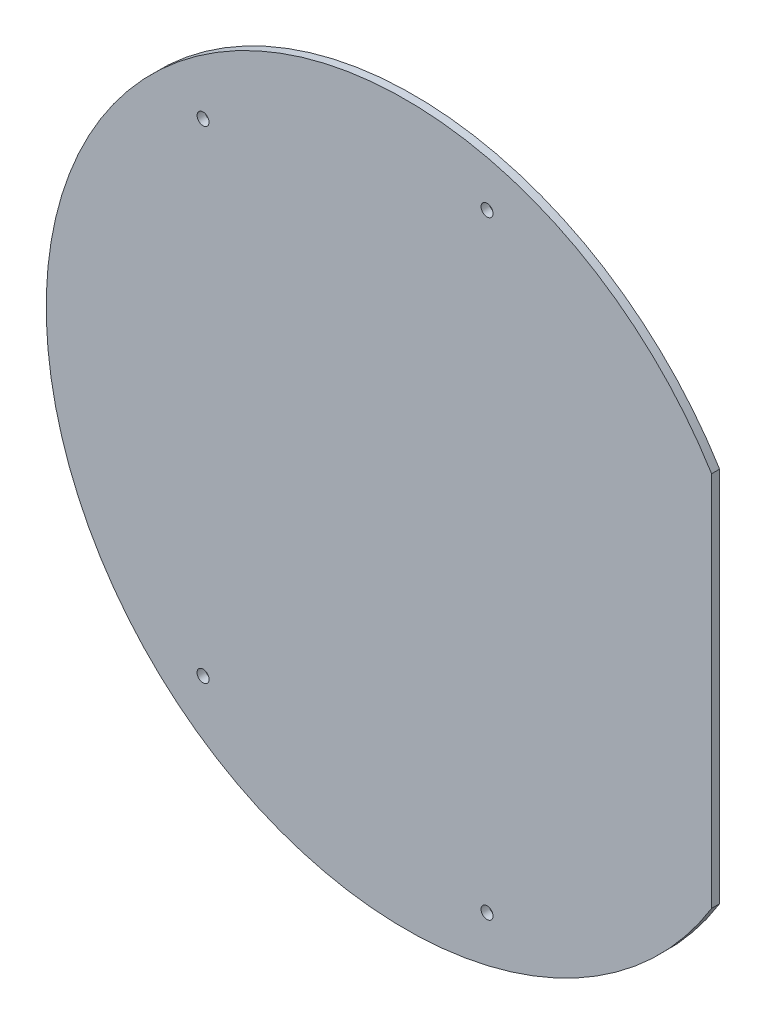
ISO-10303-21;
HEADER;
FILE_DESCRIPTION(('STEP AP214'),'2;1');
FILE_NAME('part.step','',(''),(''),'','','');
FILE_SCHEMA(('AUTOMOTIVE_DESIGN { 1 0 10303 214 1 1 1 1 }'));
ENDSEC;
DATA;
#1=APPLICATION_CONTEXT('core data for automotive mechanical design processes');
#2=APPLICATION_PROTOCOL_DEFINITION('international standard','automotive_design',2000,#1);
#3=PRODUCT_CONTEXT('',#1,'mechanical');
#4=PRODUCT('Part','Part','',(#3));
#5=PRODUCT_RELATED_PRODUCT_CATEGORY('part','',(#4));
#6=PRODUCT_DEFINITION_FORMATION('','',#4);
#7=PRODUCT_DEFINITION_CONTEXT('part definition',#1,'design');
#8=PRODUCT_DEFINITION('design','',#6,#7);
#9=PRODUCT_DEFINITION_SHAPE('','',#8);
#10=(LENGTH_UNIT() NAMED_UNIT(*) SI_UNIT(.MILLI.,.METRE.));
#11=(NAMED_UNIT(*) PLANE_ANGLE_UNIT() SI_UNIT($,.RADIAN.));
#12=(NAMED_UNIT(*) SI_UNIT($,.STERADIAN.) SOLID_ANGLE_UNIT());
#13=UNCERTAINTY_MEASURE_WITH_UNIT(LENGTH_MEASURE(1.E-05),#10,'distance_accuracy_value','');
#14=(GEOMETRIC_REPRESENTATION_CONTEXT(3) GLOBAL_UNCERTAINTY_ASSIGNED_CONTEXT((#13)) GLOBAL_UNIT_ASSIGNED_CONTEXT((#10,
#11,#12)) REPRESENTATION_CONTEXT('',''));
#15=CARTESIAN_POINT('',(0.,0.,0.));
#16=DIRECTION('',(0.,0.,1.));
#17=DIRECTION('',(1.,0.,0.));
#18=AXIS2_PLACEMENT_3D('',#15,#16,#17);
#19=CARTESIAN_POINT('',(115.,-70.7106781186548,0.));
#20=DIRECTION('',(-1.,0.,0.));
#21=DIRECTION('',(0.,1.,0.));
#22=AXIS2_PLACEMENT_3D('',#19,#20,#21);
#23=PLANE('',#22);
#24=DIRECTION('',(0.,-1.,0.));
#25=VECTOR('',#24,1.);
#26=CARTESIAN_POINT('',(115.,-70.7106781186548,3.));
#27=LINE('',#26,#25);
#28=CARTESIAN_POINT('',(115.,70.7106781186548,3.));
#29=VERTEX_POINT('',#28);
#30=CARTESIAN_POINT('',(115.,-70.7106781186548,3.));
#31=VERTEX_POINT('',#30);
#32=EDGE_CURVE('E59',#29,#31,#27,.T.);
#33=ORIENTED_EDGE('',*,*,#32,.T.);
#34=DIRECTION('',(0.,0.,1.));
#35=VECTOR('',#34,1.);
#36=CARTESIAN_POINT('',(115.,-70.7106781186548,0.));
#37=LINE('',#36,#35);
#38=CARTESIAN_POINT('',(115.,-70.7106781186548,0.));
#39=VERTEX_POINT('',#38);
#40=EDGE_CURVE('E124',#39,#31,#37,.T.);
#41=ORIENTED_EDGE('',*,*,#40,.F.);
#42=DIRECTION('',(0.,-1.,0.));
#43=VECTOR('',#42,1.);
#44=CARTESIAN_POINT('',(115.,-70.7106781186548,0.));
#45=LINE('',#44,#43);
#46=CARTESIAN_POINT('',(115.,70.7106781186548,0.));
#47=VERTEX_POINT('',#46);
#48=EDGE_CURVE('E101',#47,#39,#45,.T.);
#49=ORIENTED_EDGE('',*,*,#48,.F.);
#50=DIRECTION('',(0.,0.,1.));
#51=VECTOR('',#50,1.);
#52=CARTESIAN_POINT('',(115.,70.7106781186548,0.));
#53=LINE('',#52,#51);
#54=EDGE_CURVE('E134',#47,#29,#53,.T.);
#55=ORIENTED_EDGE('',*,*,#54,.T.);
#56=EDGE_LOOP('',(#33,#41,#49,#55));
#57=FACE_BOUND('',#56,.T.);
#58=ADVANCED_FACE('F16',(#57),#23,.F.);
#59=CARTESIAN_POINT('',(-76.0694494261891,-90.6261822735256,3.));
#60=DIRECTION('',(0.,0.,1.));
#61=DIRECTION('',(1.,0.,0.));
#62=AXIS2_PLACEMENT_3D('',#59,#60,#61);
#63=CYLINDRICAL_SURFACE('',#62,2.25);
#64=CARTESIAN_POINT('',(-76.0694494261891,-90.6261822735256,0.));
#65=DIRECTION('',(0.,0.,1.));
#66=DIRECTION('',(1.,0.,0.));
#67=AXIS2_PLACEMENT_3D('',#64,#65,#66);
#68=CIRCLE('',#67,2.25);
#69=CARTESIAN_POINT('',(-73.8194494261891,-90.6261822735256,0.));
#70=VERTEX_POINT('',#69);
#71=EDGE_CURVE('E109',#70,#70,#68,.T.);
#72=ORIENTED_EDGE('',*,*,#71,.F.);
#73=EDGE_LOOP('',(#72));
#74=FACE_BOUND('',#73,.T.);
#75=CARTESIAN_POINT('',(-76.0694494261891,-90.6261822735256,3.));
#76=DIRECTION('',(0.,0.,1.));
#77=DIRECTION('',(1.,0.,0.));
#78=AXIS2_PLACEMENT_3D('',#75,#76,#77);
#79=CIRCLE('',#78,2.25);
#80=CARTESIAN_POINT('',(-73.8194494261891,-90.6261822735256,3.));
#81=VERTEX_POINT('',#80);
#82=EDGE_CURVE('E115',#81,#81,#79,.T.);
#83=ORIENTED_EDGE('',*,*,#82,.T.);
#84=EDGE_LOOP('',(#83));
#85=FACE_BOUND('',#84,.T.);
#86=ADVANCED_FACE('F150',(#74,#85),#63,.F.);
#87=CARTESIAN_POINT('',(30.6294366010833,-114.280755815719,3.));
#88=DIRECTION('',(0.,0.,1.));
#89=DIRECTION('',(1.,0.,0.));
#90=AXIS2_PLACEMENT_3D('',#87,#88,#89);
#91=CYLINDRICAL_SURFACE('',#90,2.25);
#92=CARTESIAN_POINT('',(30.6294366010833,-114.280755815719,0.));
#93=DIRECTION('',(0.,0.,1.));
#94=DIRECTION('',(1.,0.,0.));
#95=AXIS2_PLACEMENT_3D('',#92,#93,#94);
#96=CIRCLE('',#95,2.25);
#97=CARTESIAN_POINT('',(32.8794366010832,-114.280755815719,0.));
#98=VERTEX_POINT('',#97);
#99=EDGE_CURVE('E139',#98,#98,#96,.T.);
#100=ORIENTED_EDGE('',*,*,#99,.F.);
#101=EDGE_LOOP('',(#100));
#102=FACE_BOUND('',#101,.T.);
#103=CARTESIAN_POINT('',(30.6294366010833,-114.280755815719,3.));
#104=DIRECTION('',(0.,0.,1.));
#105=DIRECTION('',(1.,0.,0.));
#106=AXIS2_PLACEMENT_3D('',#103,#104,#105);
#107=CIRCLE('',#106,2.25);
#108=CARTESIAN_POINT('',(32.8794366010832,-114.280755815719,3.));
#109=VERTEX_POINT('',#108);
#110=EDGE_CURVE('E111',#109,#109,#107,.T.);
#111=ORIENTED_EDGE('',*,*,#110,.T.);
#112=EDGE_LOOP('',(#111));
#113=FACE_BOUND('',#112,.T.);
#114=ADVANCED_FACE('F152',(#102,#113),#91,.F.);
#115=CARTESIAN_POINT('',(30.6294366010833,114.310613316101,3.));
#116=DIRECTION('',(0.,0.,1.));
#117=DIRECTION('',(1.,0.,0.));
#118=AXIS2_PLACEMENT_3D('',#115,#116,#117);
#119=CYLINDRICAL_SURFACE('',#118,2.25);
#120=CARTESIAN_POINT('',(30.6294366010833,114.310613316101,0.));
#121=DIRECTION('',(0.,0.,1.));
#122=DIRECTION('',(1.,0.,0.));
#123=AXIS2_PLACEMENT_3D('',#120,#121,#122);
#124=CIRCLE('',#123,2.25);
#125=CARTESIAN_POINT('',(32.8794366010832,114.310613316101,0.));
#126=VERTEX_POINT('',#125);
#127=EDGE_CURVE('E27',#126,#126,#124,.T.);
#128=ORIENTED_EDGE('',*,*,#127,.F.);
#129=EDGE_LOOP('',(#128));
#130=FACE_BOUND('',#129,.T.);
#131=CARTESIAN_POINT('',(30.6294366010833,114.310613316101,3.));
#132=DIRECTION('',(0.,0.,1.));
#133=DIRECTION('',(1.,0.,0.));
#134=AXIS2_PLACEMENT_3D('',#131,#132,#133);
#135=CIRCLE('',#134,2.25);
#136=CARTESIAN_POINT('',(32.8794366010832,114.310613316101,3.));
#137=VERTEX_POINT('',#136);
#138=EDGE_CURVE('E20',#137,#137,#135,.T.);
#139=ORIENTED_EDGE('',*,*,#138,.T.);
#140=EDGE_LOOP('',(#139));
#141=FACE_BOUND('',#140,.T.);
#142=ADVANCED_FACE('F159',(#130,#141),#119,.F.);
#143=CARTESIAN_POINT('',(-76.0694494261891,90.6560397739075,3.));
#144=DIRECTION('',(0.,0.,1.));
#145=DIRECTION('',(1.,0.,0.));
#146=AXIS2_PLACEMENT_3D('',#143,#144,#145);
#147=CYLINDRICAL_SURFACE('',#146,2.25);
#148=CARTESIAN_POINT('',(-76.0694494261891,90.6560397739075,0.));
#149=DIRECTION('',(0.,0.,1.));
#150=DIRECTION('',(1.,0.,0.));
#151=AXIS2_PLACEMENT_3D('',#148,#149,#150);
#152=CIRCLE('',#151,2.25);
#153=CARTESIAN_POINT('',(-73.8194494261891,90.6560397739075,0.));
#154=VERTEX_POINT('',#153);
#155=EDGE_CURVE('E11',#154,#154,#152,.T.);
#156=ORIENTED_EDGE('',*,*,#155,.F.);
#157=EDGE_LOOP('',(#156));
#158=FACE_BOUND('',#157,.T.);
#159=CARTESIAN_POINT('',(-76.0694494261891,90.6560397739075,3.));
#160=DIRECTION('',(0.,0.,1.));
#161=DIRECTION('',(1.,0.,0.));
#162=AXIS2_PLACEMENT_3D('',#159,#160,#161);
#163=CIRCLE('',#162,2.25);
#164=CARTESIAN_POINT('',(-73.8194494261891,90.6560397739075,3.));
#165=VERTEX_POINT('',#164);
#166=EDGE_CURVE('E97',#165,#165,#163,.T.);
#167=ORIENTED_EDGE('',*,*,#166,.T.);
#168=EDGE_LOOP('',(#167));
#169=FACE_BOUND('',#168,.T.);
#170=ADVANCED_FACE('F98',(#158,#169),#147,.F.);
#171=CARTESIAN_POINT('',(0.,0.,0.));
#172=DIRECTION('',(0.,0.,1.));
#173=DIRECTION('',(1.,0.,0.));
#174=AXIS2_PLACEMENT_3D('',#171,#172,#173);
#175=PLANE('',#174);
#176=ORIENTED_EDGE('',*,*,#155,.T.);
#177=EDGE_LOOP('',(#176));
#178=FACE_BOUND('',#177,.T.);
#179=ORIENTED_EDGE('',*,*,#127,.T.);
#180=EDGE_LOOP('',(#179));
#181=FACE_BOUND('',#180,.T.);
#182=ORIENTED_EDGE('',*,*,#99,.T.);
#183=EDGE_LOOP('',(#182));
#184=FACE_BOUND('',#183,.T.);
#185=ORIENTED_EDGE('',*,*,#71,.T.);
#186=EDGE_LOOP('',(#185));
#187=FACE_BOUND('',#186,.T.);
#188=CARTESIAN_POINT('',(0.,0.,0.));
#189=DIRECTION('',(0.,0.,1.));
#190=DIRECTION('',(1.,0.,0.));
#191=AXIS2_PLACEMENT_3D('',#188,#189,#190);
#192=CIRCLE('',#191,135.);
#193=EDGE_CURVE('E128',#47,#39,#192,.T.);
#194=ORIENTED_EDGE('',*,*,#193,.F.);
#195=ORIENTED_EDGE('',*,*,#48,.T.);
#196=EDGE_LOOP('',(#194,#195));
#197=FACE_BOUND('',#196,.T.);
#198=ADVANCED_FACE('F147',(#178,#181,#184,#187,#197),#175,.F.);
#199=CARTESIAN_POINT('',(0.,0.,3.));
#200=DIRECTION('',(0.,0.,1.));
#201=DIRECTION('',(1.,0.,0.));
#202=AXIS2_PLACEMENT_3D('',#199,#200,#201);
#203=PLANE('',#202);
#204=ORIENTED_EDGE('',*,*,#166,.F.);
#205=EDGE_LOOP('',(#204));
#206=FACE_BOUND('',#205,.T.);
#207=ORIENTED_EDGE('',*,*,#138,.F.);
#208=EDGE_LOOP('',(#207));
#209=FACE_BOUND('',#208,.T.);
#210=ORIENTED_EDGE('',*,*,#110,.F.);
#211=EDGE_LOOP('',(#210));
#212=FACE_BOUND('',#211,.T.);
#213=ORIENTED_EDGE('',*,*,#82,.F.);
#214=EDGE_LOOP('',(#213));
#215=FACE_BOUND('',#214,.T.);
#216=ORIENTED_EDGE('',*,*,#32,.F.);
#217=CARTESIAN_POINT('',(0.,0.,3.));
#218=DIRECTION('',(0.,0.,1.));
#219=DIRECTION('',(1.,0.,0.));
#220=AXIS2_PLACEMENT_3D('',#217,#218,#219);
#221=CIRCLE('',#220,135.);
#222=EDGE_CURVE('E113',#29,#31,#221,.T.);
#223=ORIENTED_EDGE('',*,*,#222,.T.);
#224=EDGE_LOOP('',(#216,#223));
#225=FACE_BOUND('',#224,.T.);
#226=ADVANCED_FACE('F166',(#206,#209,#212,#215,#225),#203,.T.);
#227=CARTESIAN_POINT('',(0.,0.,3.));
#228=DIRECTION('',(0.,0.,-1.));
#229=DIRECTION('',(-1.,0.,0.));
#230=AXIS2_PLACEMENT_3D('',#227,#228,#229);
#231=CYLINDRICAL_SURFACE('',#230,135.);
#232=ORIENTED_EDGE('',*,*,#222,.F.);
#233=ORIENTED_EDGE('',*,*,#54,.F.);
#234=ORIENTED_EDGE('',*,*,#193,.T.);
#235=ORIENTED_EDGE('',*,*,#40,.T.);
#236=EDGE_LOOP('',(#232,#233,#234,#235));
#237=FACE_BOUND('',#236,.T.);
#238=ADVANCED_FACE('F18',(#237),#231,.T.);
#239=CLOSED_SHELL('',(#58,#86,#114,#142,#170,#198,#226,#238));
#240=MANIFOLD_SOLID_BREP('B1',#239);
#241=ADVANCED_BREP_SHAPE_REPRESENTATION('',(#18,#240),#14);
#242=SHAPE_DEFINITION_REPRESENTATION(#9,#241);
ENDSEC;
END-ISO-10303-21;
